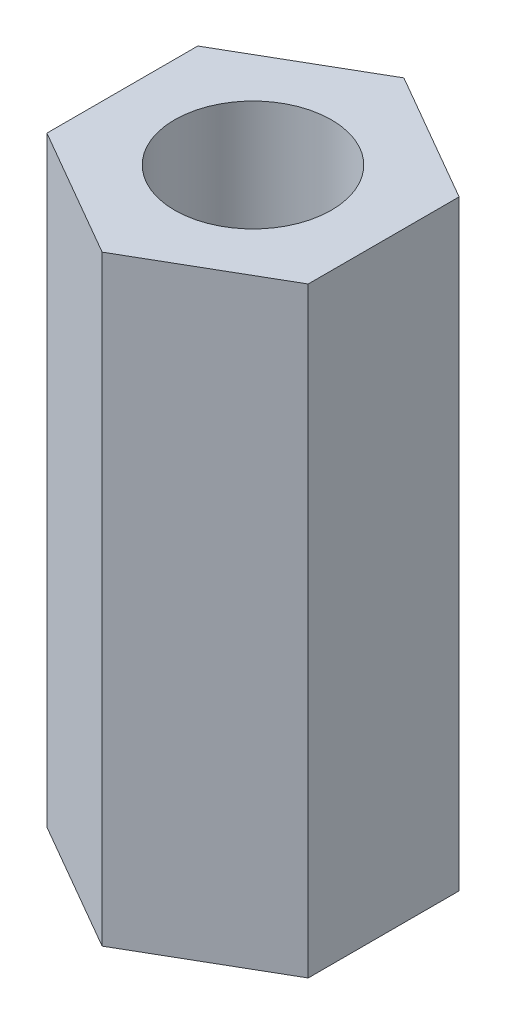
ISO-10303-21;
HEADER;
FILE_DESCRIPTION(('STEP AP214'),'2;1');
FILE_NAME('part.step','',(''),(''),'','','');
FILE_SCHEMA(('AUTOMOTIVE_DESIGN { 1 0 10303 214 1 1 1 1 }'));
ENDSEC;
DATA;
#1=APPLICATION_CONTEXT('core data for automotive mechanical design processes');
#2=APPLICATION_PROTOCOL_DEFINITION('international standard','automotive_design',2000,#1);
#3=PRODUCT_CONTEXT('',#1,'mechanical');
#4=PRODUCT('Part','Part','',(#3));
#5=PRODUCT_RELATED_PRODUCT_CATEGORY('part','',(#4));
#6=PRODUCT_DEFINITION_FORMATION('','',#4);
#7=PRODUCT_DEFINITION_CONTEXT('part definition',#1,'design');
#8=PRODUCT_DEFINITION('design','',#6,#7);
#9=PRODUCT_DEFINITION_SHAPE('','',#8);
#10=(LENGTH_UNIT() NAMED_UNIT(*) SI_UNIT(.MILLI.,.METRE.));
#11=(NAMED_UNIT(*) PLANE_ANGLE_UNIT() SI_UNIT($,.RADIAN.));
#12=(NAMED_UNIT(*) SI_UNIT($,.STERADIAN.) SOLID_ANGLE_UNIT());
#13=UNCERTAINTY_MEASURE_WITH_UNIT(LENGTH_MEASURE(1.E-05),#10,'distance_accuracy_value','');
#14=(GEOMETRIC_REPRESENTATION_CONTEXT(3) GLOBAL_UNCERTAINTY_ASSIGNED_CONTEXT((#13)) GLOBAL_UNIT_ASSIGNED_CONTEXT((#10,
#11,#12)) REPRESENTATION_CONTEXT('',''));
#15=CARTESIAN_POINT('',(0.,0.,0.));
#16=DIRECTION('',(0.,0.,1.));
#17=DIRECTION('',(1.,0.,0.));
#18=AXIS2_PLACEMENT_3D('',#15,#16,#17);
#19=CARTESIAN_POINT('',(0.,11.5,0.));
#20=DIRECTION('',(0.,1.,0.));
#21=DIRECTION('',(0.,0.,1.));
#22=AXIS2_PLACEMENT_3D('',#19,#20,#21);
#23=PLANE('',#22);
#24=DIRECTION('',(0.866025403784442,0.,0.499999999999995));
#25=VECTOR('',#24,1.);
#26=CARTESIAN_POINT('',(-2.49999999999999,11.5,1.44337567297409));
#27=LINE('',#26,#25);
#28=CARTESIAN_POINT('',(-2.49999999999999,11.5,1.44337567297409));
#29=VERTEX_POINT('',#28);
#30=CARTESIAN_POINT('',(0.,11.5,2.88675134594813));
#31=VERTEX_POINT('',#30);
#32=EDGE_CURVE('E132',#29,#31,#27,.T.);
#33=ORIENTED_EDGE('',*,*,#32,.T.);
#34=DIRECTION('',(0.866025403784438,0.,-0.500000000000001));
#35=VECTOR('',#34,1.);
#36=CARTESIAN_POINT('',(0.,11.5,2.88675134594813));
#37=LINE('',#36,#35);
#38=CARTESIAN_POINT('',(2.50000000000001,11.5,1.44337567297406));
#39=VERTEX_POINT('',#38);
#40=EDGE_CURVE('E90',#31,#39,#37,.T.);
#41=ORIENTED_EDGE('',*,*,#40,.T.);
#42=DIRECTION('',(0.,0.,-1.));
#43=VECTOR('',#42,1.);
#44=CARTESIAN_POINT('',(2.50000000000001,11.5,1.44337567297406));
#45=LINE('',#44,#43);
#46=CARTESIAN_POINT('',(2.5,11.5,-1.44337567297408));
#47=VERTEX_POINT('',#46);
#48=EDGE_CURVE('E103',#39,#47,#45,.T.);
#49=ORIENTED_EDGE('',*,*,#48,.T.);
#50=DIRECTION('',(-0.866025403784441,0.,-0.499999999999995));
#51=VECTOR('',#50,1.);
#52=CARTESIAN_POINT('',(2.5,11.5,-1.44337567297408));
#53=LINE('',#52,#51);
#54=CARTESIAN_POINT('',(0.,11.5,-2.88675134594813));
#55=VERTEX_POINT('',#54);
#56=EDGE_CURVE('E97',#47,#55,#53,.T.);
#57=ORIENTED_EDGE('',*,*,#56,.T.);
#58=DIRECTION('',(-0.866025403784435,0.,0.500000000000007));
#59=VECTOR('',#58,1.);
#60=CARTESIAN_POINT('',(0.,11.5,-2.88675134594813));
#61=LINE('',#60,#59);
#62=CARTESIAN_POINT('',(-2.50000000000002,11.5,-1.44337567297404));
#63=VERTEX_POINT('',#62);
#64=EDGE_CURVE('E101',#55,#63,#61,.T.);
#65=ORIENTED_EDGE('',*,*,#64,.T.);
#66=DIRECTION('',(0.,0.,1.));
#67=VECTOR('',#66,1.);
#68=CARTESIAN_POINT('',(-2.50000000000002,11.5,-1.44337567297404));
#69=LINE('',#68,#67);
#70=EDGE_CURVE('E53',#63,#29,#69,.T.);
#71=ORIENTED_EDGE('',*,*,#70,.T.);
#72=EDGE_LOOP('',(#33,#41,#49,#57,#65,#71));
#73=FACE_BOUND('',#72,.T.);
#74=CARTESIAN_POINT('',(0.,11.5,0.));
#75=DIRECTION('',(0.,1.,0.));
#76=DIRECTION('',(0.,0.,1.));
#77=AXIS2_PLACEMENT_3D('',#74,#75,#76);
#78=CIRCLE('',#77,1.5);
#79=CARTESIAN_POINT('',(0.,11.5,1.5));
#80=VERTEX_POINT('',#79);
#81=EDGE_CURVE('E125',#80,#80,#78,.T.);
#82=ORIENTED_EDGE('',*,*,#81,.F.);
#83=EDGE_LOOP('',(#82));
#84=FACE_BOUND('',#83,.T.);
#85=ADVANCED_FACE('F36',(#73,#84),#23,.T.);
#86=CARTESIAN_POINT('',(0.,0.,0.));
#87=DIRECTION('',(0.,1.,0.));
#88=DIRECTION('',(0.,0.,1.));
#89=AXIS2_PLACEMENT_3D('',#86,#87,#88);
#90=PLANE('',#89);
#91=DIRECTION('',(0.866025403784442,0.,0.499999999999995));
#92=VECTOR('',#91,1.);
#93=CARTESIAN_POINT('',(-2.49999999999999,0.,1.44337567297409));
#94=LINE('',#93,#92);
#95=CARTESIAN_POINT('',(-2.49999999999999,0.,1.44337567297409));
#96=VERTEX_POINT('',#95);
#97=CARTESIAN_POINT('',(0.,0.,2.88675134594813));
#98=VERTEX_POINT('',#97);
#99=EDGE_CURVE('E121',#96,#98,#94,.T.);
#100=ORIENTED_EDGE('',*,*,#99,.F.);
#101=DIRECTION('',(0.,0.,1.));
#102=VECTOR('',#101,1.);
#103=CARTESIAN_POINT('',(-2.50000000000002,0.,-1.44337567297404));
#104=LINE('',#103,#102);
#105=CARTESIAN_POINT('',(-2.50000000000002,0.,-1.44337567297404));
#106=VERTEX_POINT('',#105);
#107=EDGE_CURVE('E82',#106,#96,#104,.T.);
#108=ORIENTED_EDGE('',*,*,#107,.F.);
#109=DIRECTION('',(-0.866025403784435,0.,0.500000000000007));
#110=VECTOR('',#109,1.);
#111=CARTESIAN_POINT('',(0.,0.,-2.88675134594813));
#112=LINE('',#111,#110);
#113=CARTESIAN_POINT('',(0.,0.,-2.88675134594813));
#114=VERTEX_POINT('',#113);
#115=EDGE_CURVE('E76',#114,#106,#112,.T.);
#116=ORIENTED_EDGE('',*,*,#115,.F.);
#117=DIRECTION('',(-0.866025403784441,0.,-0.499999999999995));
#118=VECTOR('',#117,1.);
#119=CARTESIAN_POINT('',(2.5,0.,-1.44337567297408));
#120=LINE('',#119,#118);
#121=CARTESIAN_POINT('',(2.5,0.,-1.44337567297408));
#122=VERTEX_POINT('',#121);
#123=EDGE_CURVE('E111',#122,#114,#120,.T.);
#124=ORIENTED_EDGE('',*,*,#123,.F.);
#125=DIRECTION('',(0.,0.,-1.));
#126=VECTOR('',#125,1.);
#127=CARTESIAN_POINT('',(2.50000000000001,0.,1.44337567297406));
#128=LINE('',#127,#126);
#129=CARTESIAN_POINT('',(2.50000000000001,0.,1.44337567297406));
#130=VERTEX_POINT('',#129);
#131=EDGE_CURVE('E127',#130,#122,#128,.T.);
#132=ORIENTED_EDGE('',*,*,#131,.F.);
#133=DIRECTION('',(0.866025403784438,0.,-0.500000000000001));
#134=VECTOR('',#133,1.);
#135=CARTESIAN_POINT('',(0.,0.,2.88675134594813));
#136=LINE('',#135,#134);
#137=EDGE_CURVE('E124',#98,#130,#136,.T.);
#138=ORIENTED_EDGE('',*,*,#137,.F.);
#139=EDGE_LOOP('',(#100,#108,#116,#124,#132,#138));
#140=FACE_BOUND('',#139,.T.);
#141=CARTESIAN_POINT('',(0.,0.,0.));
#142=DIRECTION('',(0.,1.,0.));
#143=DIRECTION('',(0.,0.,1.));
#144=AXIS2_PLACEMENT_3D('',#141,#142,#143);
#145=CIRCLE('',#144,1.5);
#146=CARTESIAN_POINT('',(0.,0.,1.5));
#147=VERTEX_POINT('',#146);
#148=EDGE_CURVE('E225',#147,#147,#145,.T.);
#149=ORIENTED_EDGE('',*,*,#148,.T.);
#150=EDGE_LOOP('',(#149));
#151=FACE_BOUND('',#150,.T.);
#152=ADVANCED_FACE('F141',(#140,#151),#90,.F.);
#153=CARTESIAN_POINT('',(-2.49999999999999,11.5,1.44337567297409));
#154=DIRECTION('',(0.499999999999995,0.,-0.866025403784441));
#155=DIRECTION('',(-0.866025403784442,0.,-0.499999999999995));
#156=AXIS2_PLACEMENT_3D('',#153,#154,#155);
#157=PLANE('',#156);
#158=ORIENTED_EDGE('',*,*,#99,.T.);
#159=DIRECTION('',(0.,-1.,0.));
#160=VECTOR('',#159,1.);
#161=CARTESIAN_POINT('',(0.,11.5,2.88675134594813));
#162=LINE('',#161,#160);
#163=EDGE_CURVE('E11',#31,#98,#162,.T.);
#164=ORIENTED_EDGE('',*,*,#163,.F.);
#165=ORIENTED_EDGE('',*,*,#32,.F.);
#166=DIRECTION('',(0.,-1.,0.));
#167=VECTOR('',#166,1.);
#168=CARTESIAN_POINT('',(-2.49999999999999,11.5,1.44337567297409));
#169=LINE('',#168,#167);
#170=EDGE_CURVE('E117',#29,#96,#169,.T.);
#171=ORIENTED_EDGE('',*,*,#170,.T.);
#172=EDGE_LOOP('',(#158,#164,#165,#171));
#173=FACE_BOUND('',#172,.T.);
#174=ADVANCED_FACE('F38',(#173),#157,.F.);
#175=CARTESIAN_POINT('',(0.,11.5,2.88675134594813));
#176=DIRECTION('',(-0.500000000000001,0.,-0.866025403784438));
#177=DIRECTION('',(-0.866025403784438,0.,0.500000000000001));
#178=AXIS2_PLACEMENT_3D('',#175,#176,#177);
#179=PLANE('',#178);
#180=ORIENTED_EDGE('',*,*,#137,.T.);
#181=DIRECTION('',(0.,-1.,0.));
#182=VECTOR('',#181,1.);
#183=CARTESIAN_POINT('',(2.50000000000001,11.5,1.44337567297406));
#184=LINE('',#183,#182);
#185=EDGE_CURVE('E45',#39,#130,#184,.T.);
#186=ORIENTED_EDGE('',*,*,#185,.F.);
#187=ORIENTED_EDGE('',*,*,#40,.F.);
#188=ORIENTED_EDGE('',*,*,#163,.T.);
#189=EDGE_LOOP('',(#180,#186,#187,#188));
#190=FACE_BOUND('',#189,.T.);
#191=ADVANCED_FACE('F166',(#190),#179,.F.);
#192=CARTESIAN_POINT('',(2.50000000000001,11.5,1.44337567297406));
#193=DIRECTION('',(-1.,0.,0.));
#194=DIRECTION('',(0.,0.,1.));
#195=AXIS2_PLACEMENT_3D('',#192,#193,#194);
#196=PLANE('',#195);
#197=ORIENTED_EDGE('',*,*,#131,.T.);
#198=DIRECTION('',(0.,-1.,0.));
#199=VECTOR('',#198,1.);
#200=CARTESIAN_POINT('',(2.5,11.5,-1.44337567297408));
#201=LINE('',#200,#199);
#202=EDGE_CURVE('E112',#47,#122,#201,.T.);
#203=ORIENTED_EDGE('',*,*,#202,.F.);
#204=ORIENTED_EDGE('',*,*,#48,.F.);
#205=ORIENTED_EDGE('',*,*,#185,.T.);
#206=EDGE_LOOP('',(#197,#203,#204,#205));
#207=FACE_BOUND('',#206,.T.);
#208=ADVANCED_FACE('F138',(#207),#196,.F.);
#209=CARTESIAN_POINT('',(2.5,11.5,-1.44337567297408));
#210=DIRECTION('',(-0.499999999999995,0.,0.866025403784441));
#211=DIRECTION('',(0.866025403784441,0.,0.499999999999995));
#212=AXIS2_PLACEMENT_3D('',#209,#210,#211);
#213=PLANE('',#212);
#214=ORIENTED_EDGE('',*,*,#123,.T.);
#215=DIRECTION('',(0.,-1.,0.));
#216=VECTOR('',#215,1.);
#217=CARTESIAN_POINT('',(0.,11.5,-2.88675134594813));
#218=LINE('',#217,#216);
#219=EDGE_CURVE('E108',#55,#114,#218,.T.);
#220=ORIENTED_EDGE('',*,*,#219,.F.);
#221=ORIENTED_EDGE('',*,*,#56,.F.);
#222=ORIENTED_EDGE('',*,*,#202,.T.);
#223=EDGE_LOOP('',(#214,#220,#221,#222));
#224=FACE_BOUND('',#223,.T.);
#225=ADVANCED_FACE('F109',(#224),#213,.F.);
#226=CARTESIAN_POINT('',(0.,11.5,-2.88675134594813));
#227=DIRECTION('',(0.500000000000007,0.,0.866025403784434));
#228=DIRECTION('',(0.866025403784435,0.,-0.500000000000007));
#229=AXIS2_PLACEMENT_3D('',#226,#227,#228);
#230=PLANE('',#229);
#231=ORIENTED_EDGE('',*,*,#115,.T.);
#232=DIRECTION('',(0.,-1.,0.));
#233=VECTOR('',#232,1.);
#234=CARTESIAN_POINT('',(-2.50000000000002,11.5,-1.44337567297404));
#235=LINE('',#234,#233);
#236=EDGE_CURVE('E113',#63,#106,#235,.T.);
#237=ORIENTED_EDGE('',*,*,#236,.F.);
#238=ORIENTED_EDGE('',*,*,#64,.F.);
#239=ORIENTED_EDGE('',*,*,#219,.T.);
#240=EDGE_LOOP('',(#231,#237,#238,#239));
#241=FACE_BOUND('',#240,.T.);
#242=ADVANCED_FACE('F115',(#241),#230,.F.);
#243=CARTESIAN_POINT('',(-2.50000000000002,11.5,-1.44337567297404));
#244=DIRECTION('',(1.,0.,0.));
#245=DIRECTION('',(0.,0.,-1.));
#246=AXIS2_PLACEMENT_3D('',#243,#244,#245);
#247=PLANE('',#246);
#248=ORIENTED_EDGE('',*,*,#107,.T.);
#249=ORIENTED_EDGE('',*,*,#170,.F.);
#250=ORIENTED_EDGE('',*,*,#70,.F.);
#251=ORIENTED_EDGE('',*,*,#236,.T.);
#252=EDGE_LOOP('',(#248,#249,#250,#251));
#253=FACE_BOUND('',#252,.T.);
#254=ADVANCED_FACE('F146',(#253),#247,.F.);
#255=CARTESIAN_POINT('',(0.,11.5,0.));
#256=DIRECTION('',(0.,-1.,0.));
#257=DIRECTION('',(0.,0.,-1.));
#258=AXIS2_PLACEMENT_3D('',#255,#256,#257);
#259=CYLINDRICAL_SURFACE('',#258,1.5);
#260=ORIENTED_EDGE('',*,*,#81,.T.);
#261=EDGE_LOOP('',(#260));
#262=FACE_BOUND('',#261,.T.);
#263=ORIENTED_EDGE('',*,*,#148,.F.);
#264=EDGE_LOOP('',(#263));
#265=FACE_BOUND('',#264,.T.);
#266=ADVANCED_FACE('F148',(#262,#265),#259,.F.);
#267=CLOSED_SHELL('',(#85,#152,#174,#191,#208,#225,#242,#254,#266));
#268=MANIFOLD_SOLID_BREP('B2',#267);
#269=ADVANCED_BREP_SHAPE_REPRESENTATION('',(#18,#268),#14);
#270=SHAPE_DEFINITION_REPRESENTATION(#9,#269);
ENDSEC;
END-ISO-10303-21;
